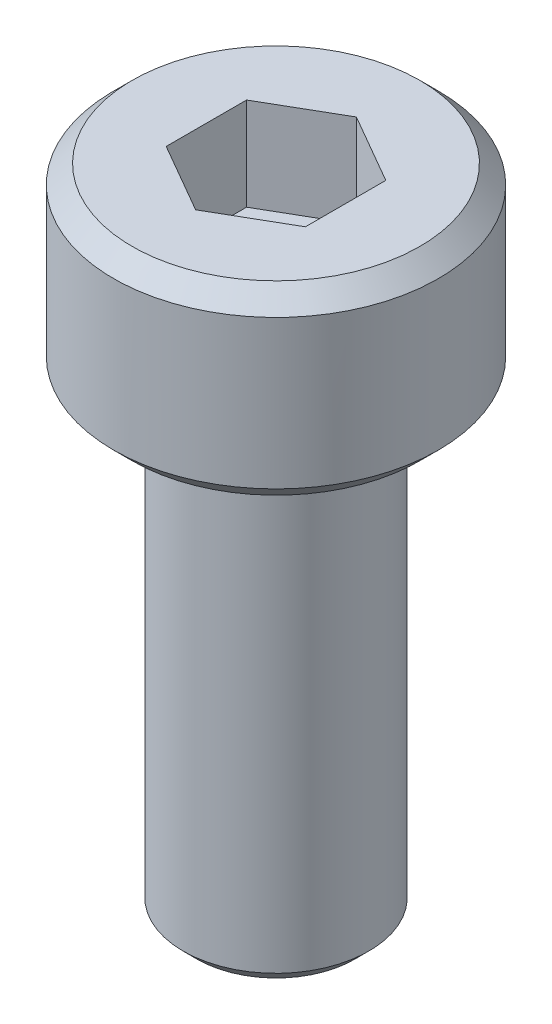
ISO-10303-21;
HEADER;
FILE_DESCRIPTION(('STEP AP214'),'2;1');
FILE_NAME('part.step','',(''),(''),'','','');
FILE_SCHEMA(('AUTOMOTIVE_DESIGN { 1 0 10303 214 1 1 1 1 }'));
ENDSEC;
DATA;
#1=APPLICATION_CONTEXT('core data for automotive mechanical design processes');
#2=APPLICATION_PROTOCOL_DEFINITION('international standard','automotive_design',2000,#1);
#3=PRODUCT_CONTEXT('',#1,'mechanical');
#4=PRODUCT('Part','Part','',(#3));
#5=PRODUCT_RELATED_PRODUCT_CATEGORY('part','',(#4));
#6=PRODUCT_DEFINITION_FORMATION('','',#4);
#7=PRODUCT_DEFINITION_CONTEXT('part definition',#1,'design');
#8=PRODUCT_DEFINITION('design','',#6,#7);
#9=PRODUCT_DEFINITION_SHAPE('','',#8);
#10=(LENGTH_UNIT() NAMED_UNIT(*) SI_UNIT(.MILLI.,.METRE.));
#11=(NAMED_UNIT(*) PLANE_ANGLE_UNIT() SI_UNIT($,.RADIAN.));
#12=(NAMED_UNIT(*) SI_UNIT($,.STERADIAN.) SOLID_ANGLE_UNIT());
#13=UNCERTAINTY_MEASURE_WITH_UNIT(LENGTH_MEASURE(1.E-05),#10,'distance_accuracy_value','');
#14=(GEOMETRIC_REPRESENTATION_CONTEXT(3) GLOBAL_UNCERTAINTY_ASSIGNED_CONTEXT((#13)) GLOBAL_UNIT_ASSIGNED_CONTEXT((#10,
#11,#12)) REPRESENTATION_CONTEXT('',''));
#15=CARTESIAN_POINT('',(0.,0.,0.));
#16=DIRECTION('',(0.,0.,1.));
#17=DIRECTION('',(1.,0.,0.));
#18=AXIS2_PLACEMENT_3D('',#15,#16,#17);
#19=CARTESIAN_POINT('',(0.,2.,-1.73205080756888));
#20=DIRECTION('',(-0.500000000000001,0.,-0.866025403784438));
#21=DIRECTION('',(-0.866025403784438,0.,0.500000000000001));
#22=AXIS2_PLACEMENT_3D('',#19,#20,#21);
#23=PLANE('',#22);
#24=DIRECTION('',(0.,1.,0.));
#25=VECTOR('',#24,1.);
#26=CARTESIAN_POINT('',(-1.5,2.,-0.866025403784438));
#27=LINE('',#26,#25);
#28=CARTESIAN_POINT('',(-1.5,4.,-0.866025403784437));
#29=VERTEX_POINT('',#28);
#30=CARTESIAN_POINT('',(-1.5,2.,-0.866025403784437));
#31=VERTEX_POINT('',#30);
#32=EDGE_CURVE('E83',#29,#31,#27,.F.);
#33=ORIENTED_EDGE('',*,*,#32,.T.);
#34=DIRECTION('',(-0.866025403784438,0.,0.500000000000001));
#35=VECTOR('',#34,1.);
#36=CARTESIAN_POINT('',(0.,2.,-1.73205080756888));
#37=LINE('',#36,#35);
#38=CARTESIAN_POINT('',(0.,2.,-1.73205080756888));
#39=VERTEX_POINT('',#38);
#40=EDGE_CURVE('E72',#39,#31,#37,.T.);
#41=ORIENTED_EDGE('',*,*,#40,.F.);
#42=DIRECTION('',(0.,1.,0.));
#43=VECTOR('',#42,1.);
#44=CARTESIAN_POINT('',(0.,2.,-1.73205080756888));
#45=LINE('',#44,#43);
#46=CARTESIAN_POINT('',(0.,4.,-1.73205080756888));
#47=VERTEX_POINT('',#46);
#48=EDGE_CURVE('E92',#39,#47,#45,.T.);
#49=ORIENTED_EDGE('',*,*,#48,.T.);
#50=DIRECTION('',(-0.866025403784438,0.,0.500000000000001));
#51=VECTOR('',#50,1.);
#52=CARTESIAN_POINT('',(0.,4.,-1.73205080756888));
#53=LINE('',#52,#51);
#54=EDGE_CURVE('E67',#29,#47,#53,.F.);
#55=ORIENTED_EDGE('',*,*,#54,.F.);
#56=EDGE_LOOP('',(#33,#41,#49,#55));
#57=FACE_BOUND('',#56,.T.);
#58=ADVANCED_FACE('F17',(#57),#23,.F.);
#59=CARTESIAN_POINT('',(-1.5,2.,-0.866025403784438));
#60=DIRECTION('',(-1.,0.,0.));
#61=DIRECTION('',(0.,0.,1.));
#62=AXIS2_PLACEMENT_3D('',#59,#60,#61);
#63=PLANE('',#62);
#64=DIRECTION('',(0.,1.,0.));
#65=VECTOR('',#64,1.);
#66=CARTESIAN_POINT('',(-1.5,2.,0.866025403784439));
#67=LINE('',#66,#65);
#68=CARTESIAN_POINT('',(-1.5,4.,0.866025403784439));
#69=VERTEX_POINT('',#68);
#70=CARTESIAN_POINT('',(-1.5,2.,0.866025403784439));
#71=VERTEX_POINT('',#70);
#72=EDGE_CURVE('E88',#69,#71,#67,.F.);
#73=ORIENTED_EDGE('',*,*,#72,.T.);
#74=DIRECTION('',(0.,0.,1.));
#75=VECTOR('',#74,1.);
#76=CARTESIAN_POINT('',(-1.5,2.,-0.866025403784438));
#77=LINE('',#76,#75);
#78=EDGE_CURVE('E76',#31,#71,#77,.T.);
#79=ORIENTED_EDGE('',*,*,#78,.F.);
#80=ORIENTED_EDGE('',*,*,#32,.F.);
#81=DIRECTION('',(0.,0.,1.));
#82=VECTOR('',#81,1.);
#83=CARTESIAN_POINT('',(-1.5,4.,-0.866025403784438));
#84=LINE('',#83,#82);
#85=EDGE_CURVE('E90',#69,#29,#84,.F.);
#86=ORIENTED_EDGE('',*,*,#85,.F.);
#87=EDGE_LOOP('',(#73,#79,#80,#86));
#88=FACE_BOUND('',#87,.T.);
#89=ADVANCED_FACE('F86',(#88),#63,.F.);
#90=CARTESIAN_POINT('',(1.5,2.,-0.866025403784438));
#91=DIRECTION('',(0.5,0.,-0.866025403784439));
#92=DIRECTION('',(-0.866025403784439,0.,-0.5));
#93=AXIS2_PLACEMENT_3D('',#90,#91,#92);
#94=PLANE('',#93);
#95=ORIENTED_EDGE('',*,*,#48,.F.);
#96=DIRECTION('',(-0.866025403784439,0.,-0.5));
#97=VECTOR('',#96,1.);
#98=CARTESIAN_POINT('',(1.5,2.,-0.866025403784438));
#99=LINE('',#98,#97);
#100=CARTESIAN_POINT('',(1.5,2.,-0.866025403784438));
#101=VERTEX_POINT('',#100);
#102=EDGE_CURVE('E79',#101,#39,#99,.T.);
#103=ORIENTED_EDGE('',*,*,#102,.F.);
#104=DIRECTION('',(0.,1.,0.));
#105=VECTOR('',#104,1.);
#106=CARTESIAN_POINT('',(1.5,2.,-0.866025403784438));
#107=LINE('',#106,#105);
#108=CARTESIAN_POINT('',(1.5,4.,-0.866025403784438));
#109=VERTEX_POINT('',#108);
#110=EDGE_CURVE('E122',#101,#109,#107,.T.);
#111=ORIENTED_EDGE('',*,*,#110,.T.);
#112=DIRECTION('',(-0.866025403784439,0.,-0.5));
#113=VECTOR('',#112,1.);
#114=CARTESIAN_POINT('',(1.5,4.,-0.866025403784438));
#115=LINE('',#114,#113);
#116=EDGE_CURVE('E134',#47,#109,#115,.F.);
#117=ORIENTED_EDGE('',*,*,#116,.F.);
#118=EDGE_LOOP('',(#95,#103,#111,#117));
#119=FACE_BOUND('',#118,.T.);
#120=ADVANCED_FACE('F137',(#119),#94,.F.);
#121=CARTESIAN_POINT('',(-1.5,2.,0.866025403784439));
#122=DIRECTION('',(-0.499999999999999,0.,0.866025403784439));
#123=DIRECTION('',(0.866025403784439,0.,0.499999999999999));
#124=AXIS2_PLACEMENT_3D('',#121,#122,#123);
#125=PLANE('',#124);
#126=DIRECTION('',(0.,1.,0.));
#127=VECTOR('',#126,1.);
#128=CARTESIAN_POINT('',(0.,2.,1.73205080756888));
#129=LINE('',#128,#127);
#130=CARTESIAN_POINT('',(0.,4.,1.73205080756888));
#131=VERTEX_POINT('',#130);
#132=CARTESIAN_POINT('',(0.,2.,1.73205080756888));
#133=VERTEX_POINT('',#132);
#134=EDGE_CURVE('E119',#131,#133,#129,.F.);
#135=ORIENTED_EDGE('',*,*,#134,.T.);
#136=DIRECTION('',(0.866025403784439,0.,0.499999999999999));
#137=VECTOR('',#136,1.);
#138=CARTESIAN_POINT('',(-1.5,2.,0.866025403784439));
#139=LINE('',#138,#137);
#140=EDGE_CURVE('E128',#71,#133,#139,.T.);
#141=ORIENTED_EDGE('',*,*,#140,.F.);
#142=ORIENTED_EDGE('',*,*,#72,.F.);
#143=DIRECTION('',(0.866025403784439,0.,0.499999999999999));
#144=VECTOR('',#143,1.);
#145=CARTESIAN_POINT('',(-1.5,4.,0.866025403784439));
#146=LINE('',#145,#144);
#147=EDGE_CURVE('E130',#131,#69,#146,.F.);
#148=ORIENTED_EDGE('',*,*,#147,.F.);
#149=EDGE_LOOP('',(#135,#141,#142,#148));
#150=FACE_BOUND('',#149,.T.);
#151=ADVANCED_FACE('F144',(#150),#125,.F.);
#152=CARTESIAN_POINT('',(1.5,2.,2.59807621135331));
#153=DIRECTION('',(0.,1.,0.));
#154=DIRECTION('',(0.,0.,1.));
#155=AXIS2_PLACEMENT_3D('',#152,#153,#154);
#156=PLANE('',#155);
#157=ORIENTED_EDGE('',*,*,#40,.T.);
#158=ORIENTED_EDGE('',*,*,#78,.T.);
#159=ORIENTED_EDGE('',*,*,#140,.T.);
#160=DIRECTION('',(0.866025403784438,0.,-0.5));
#161=VECTOR('',#160,1.);
#162=CARTESIAN_POINT('',(0.,2.,1.73205080756888));
#163=LINE('',#162,#161);
#164=CARTESIAN_POINT('',(1.5,2.,0.866025403784438));
#165=VERTEX_POINT('',#164);
#166=EDGE_CURVE('E117',#133,#165,#163,.T.);
#167=ORIENTED_EDGE('',*,*,#166,.T.);
#168=DIRECTION('',(0.,0.,-1.));
#169=VECTOR('',#168,1.);
#170=CARTESIAN_POINT('',(1.5,2.,0.866025403784438));
#171=LINE('',#170,#169);
#172=EDGE_CURVE('E125',#165,#101,#171,.T.);
#173=ORIENTED_EDGE('',*,*,#172,.T.);
#174=ORIENTED_EDGE('',*,*,#102,.T.);
#175=EDGE_LOOP('',(#157,#158,#159,#167,#173,#174));
#176=FACE_BOUND('',#175,.T.);
#177=ADVANCED_FACE('F73',(#176),#156,.T.);
#178=CARTESIAN_POINT('',(1.5,2.,0.866025403784438));
#179=DIRECTION('',(1.,0.,0.));
#180=DIRECTION('',(0.,0.,-1.));
#181=AXIS2_PLACEMENT_3D('',#178,#179,#180);
#182=PLANE('',#181);
#183=ORIENTED_EDGE('',*,*,#110,.F.);
#184=ORIENTED_EDGE('',*,*,#172,.F.);
#185=DIRECTION('',(0.,1.,0.));
#186=VECTOR('',#185,1.);
#187=CARTESIAN_POINT('',(1.5,2.,0.866025403784437));
#188=LINE('',#187,#186);
#189=CARTESIAN_POINT('',(1.5,4.,0.866025403784438));
#190=VERTEX_POINT('',#189);
#191=EDGE_CURVE('E115',#165,#190,#188,.T.);
#192=ORIENTED_EDGE('',*,*,#191,.T.);
#193=DIRECTION('',(0.,0.,-1.));
#194=VECTOR('',#193,1.);
#195=CARTESIAN_POINT('',(1.5,4.,0.866025403784438));
#196=LINE('',#195,#194);
#197=EDGE_CURVE('E35',#109,#190,#196,.F.);
#198=ORIENTED_EDGE('',*,*,#197,.F.);
#199=EDGE_LOOP('',(#183,#184,#192,#198));
#200=FACE_BOUND('',#199,.T.);
#201=ADVANCED_FACE('F151',(#200),#182,.F.);
#202=CARTESIAN_POINT('',(0.,2.,1.73205080756888));
#203=DIRECTION('',(0.5,0.,0.866025403784438));
#204=DIRECTION('',(0.866025403784438,0.,-0.5));
#205=AXIS2_PLACEMENT_3D('',#202,#203,#204);
#206=PLANE('',#205);
#207=ORIENTED_EDGE('',*,*,#191,.F.);
#208=ORIENTED_EDGE('',*,*,#166,.F.);
#209=ORIENTED_EDGE('',*,*,#134,.F.);
#210=DIRECTION('',(-0.866025403784438,0.,0.5));
#211=VECTOR('',#210,1.);
#212=CARTESIAN_POINT('',(1.5,4.,0.866025403784438));
#213=LINE('',#212,#211);
#214=EDGE_CURVE('E113',#190,#131,#213,.T.);
#215=ORIENTED_EDGE('',*,*,#214,.F.);
#216=EDGE_LOOP('',(#207,#208,#209,#215));
#217=FACE_BOUND('',#216,.T.);
#218=ADVANCED_FACE('F149',(#217),#206,.F.);
#219=CARTESIAN_POINT('',(0.,4.,0.));
#220=DIRECTION('',(0.,1.,0.));
#221=DIRECTION('',(0.,0.,1.));
#222=AXIS2_PLACEMENT_3D('',#219,#220,#221);
#223=PLANE('',#222);
#224=ORIENTED_EDGE('',*,*,#197,.T.);
#225=ORIENTED_EDGE('',*,*,#214,.T.);
#226=ORIENTED_EDGE('',*,*,#147,.T.);
#227=ORIENTED_EDGE('',*,*,#85,.T.);
#228=ORIENTED_EDGE('',*,*,#54,.T.);
#229=ORIENTED_EDGE('',*,*,#116,.T.);
#230=EDGE_LOOP('',(#224,#225,#226,#227,#228,#229));
#231=FACE_BOUND('',#230,.T.);
#232=CARTESIAN_POINT('',(0.,4.0000000000191,0.));
#233=DIRECTION('',(0.,-1.,0.));
#234=DIRECTION('',(0.,0.,-1.));
#235=AXIS2_PLACEMENT_3D('',#232,#233,#234);
#236=CIRCLE('',#235,3.10000000001764);
#237=CARTESIAN_POINT('',(0.,4.0000000000191,-3.10000000001764));
#238=VERTEX_POINT('',#237);
#239=EDGE_CURVE('E20',#238,#238,#236,.T.);
#240=ORIENTED_EDGE('',*,*,#239,.F.);
#241=EDGE_LOOP('',(#240));
#242=FACE_BOUND('',#241,.T.);
#243=ADVANCED_FACE('F139',(#231,#242),#223,.T.);
#244=CARTESIAN_POINT('',(0.,3.60000000000582,0.));
#245=DIRECTION('',(0.,-1.,0.));
#246=DIRECTION('',(0.,0.,-1.));
#247=AXIS2_PLACEMENT_3D('',#244,#245,#246);
#248=CONICAL_SURFACE('',#247,3.50000000003092,0.785398163397448);
#249=ORIENTED_EDGE('',*,*,#239,.T.);
#250=EDGE_LOOP('',(#249));
#251=FACE_BOUND('',#250,.T.);
#252=CARTESIAN_POINT('',(0.,3.6,0.));
#253=DIRECTION('',(0.,-1.,0.));
#254=DIRECTION('',(0.,0.,-1.));
#255=AXIS2_PLACEMENT_3D('',#252,#253,#254);
#256=CIRCLE('',#255,3.5);
#257=CARTESIAN_POINT('',(0.,3.6,-3.5));
#258=VERTEX_POINT('',#257);
#259=EDGE_CURVE('E105',#258,#258,#256,.T.);
#260=ORIENTED_EDGE('',*,*,#259,.F.);
#261=EDGE_LOOP('',(#260));
#262=FACE_BOUND('',#261,.T.);
#263=ADVANCED_FACE('F188',(#251,#262),#248,.T.);
#264=CARTESIAN_POINT('',(0.,4.,0.));
#265=DIRECTION('',(0.,-1.,0.));
#266=DIRECTION('',(0.,0.,-1.));
#267=AXIS2_PLACEMENT_3D('',#264,#265,#266);
#268=CYLINDRICAL_SURFACE('',#267,3.5);
#269=ORIENTED_EDGE('',*,*,#259,.T.);
#270=EDGE_LOOP('',(#269));
#271=FACE_BOUND('',#270,.T.);
#272=CARTESIAN_POINT('',(0.,0.400000000013279,0.));
#273=DIRECTION('',(0.,1.,0.));
#274=DIRECTION('',(0.,0.,1.));
#275=AXIS2_PLACEMENT_3D('',#272,#273,#274);
#276=CIRCLE('',#275,3.50000000003092);
#277=CARTESIAN_POINT('',(0.,0.400000000013279,3.50000000003092));
#278=VERTEX_POINT('',#277);
#279=EDGE_CURVE('E101',#278,#278,#276,.F.);
#280=ORIENTED_EDGE('',*,*,#279,.F.);
#281=EDGE_LOOP('',(#280));
#282=FACE_BOUND('',#281,.T.);
#283=ADVANCED_FACE('F184',(#271,#282),#268,.T.);
#284=CARTESIAN_POINT('',(0.,-10.,0.));
#285=DIRECTION('',(0.,1.,0.));
#286=DIRECTION('',(0.,0.,1.));
#287=AXIS2_PLACEMENT_3D('',#284,#285,#286);
#288=PLANE('',#287);
#289=CARTESIAN_POINT('',(0.,-9.99999999999091,0.));
#290=DIRECTION('',(0.,1.,0.));
#291=DIRECTION('',(0.,0.,1.));
#292=AXIS2_PLACEMENT_3D('',#289,#290,#291);
#293=CIRCLE('',#292,1.70000000008486);
#294=CARTESIAN_POINT('',(0.,-9.99999999999091,1.70000000008486));
#295=VERTEX_POINT('',#294);
#296=EDGE_CURVE('E99',#295,#295,#293,.T.);
#297=ORIENTED_EDGE('',*,*,#296,.F.);
#298=EDGE_LOOP('',(#297));
#299=FACE_BOUND('',#298,.T.);
#300=ADVANCED_FACE('F180',(#299),#288,.F.);
#301=CARTESIAN_POINT('',(0.,0.399999999956435,0.));
#302=DIRECTION('',(0.,1.,0.));
#303=DIRECTION('',(0.,0.,1.));
#304=AXIS2_PLACEMENT_3D('',#301,#302,#303);
#305=CONICAL_SURFACE('',#304,3.49999999991724,0.785398163326394);
#306=CARTESIAN_POINT('',(0.,5.6843418860808E-11,0.));
#307=DIRECTION('',(0.,1.,0.));
#308=DIRECTION('',(0.,0.,1.));
#309=AXIS2_PLACEMENT_3D('',#306,#307,#308);
#310=CIRCLE('',#309,3.10000000007449);
#311=CARTESIAN_POINT('',(0.,5.6843418860808E-11,3.10000000007449));
#312=VERTEX_POINT('',#311);
#313=EDGE_CURVE('E97',#312,#312,#310,.T.);
#314=ORIENTED_EDGE('',*,*,#313,.T.);
#315=EDGE_LOOP('',(#314));
#316=FACE_BOUND('',#315,.T.);
#317=ORIENTED_EDGE('',*,*,#279,.T.);
#318=EDGE_LOOP('',(#317));
#319=FACE_BOUND('',#318,.T.);
#320=ADVANCED_FACE('F176',(#316,#319),#305,.T.);
#321=CARTESIAN_POINT('',(0.,-9.70000000012305,0.));
#322=DIRECTION('',(0.,1.,0.));
#323=DIRECTION('',(0.,0.,1.));
#324=AXIS2_PLACEMENT_3D('',#321,#322,#323);
#325=CONICAL_SURFACE('',#324,1.99999999995271,0.785398163397448);
#326=CARTESIAN_POINT('',(0.,-9.7,0.));
#327=DIRECTION('',(0.,1.,0.));
#328=DIRECTION('',(0.,0.,1.));
#329=AXIS2_PLACEMENT_3D('',#326,#327,#328);
#330=CIRCLE('',#329,2.);
#331=CARTESIAN_POINT('',(0.,-9.7,2.));
#332=VERTEX_POINT('',#331);
#333=EDGE_CURVE('E26',#332,#332,#330,.T.);
#334=ORIENTED_EDGE('',*,*,#333,.F.);
#335=EDGE_LOOP('',(#334));
#336=FACE_BOUND('',#335,.T.);
#337=ORIENTED_EDGE('',*,*,#296,.T.);
#338=EDGE_LOOP('',(#337));
#339=FACE_BOUND('',#338,.T.);
#340=ADVANCED_FACE('F169',(#336,#339),#325,.T.);
#341=CARTESIAN_POINT('',(0.,0.,0.));
#342=DIRECTION('',(0.,1.,0.));
#343=DIRECTION('',(0.,0.,1.));
#344=AXIS2_PLACEMENT_3D('',#341,#342,#343);
#345=PLANE('',#344);
#346=CARTESIAN_POINT('',(0.,0.,0.));
#347=DIRECTION('',(0.,1.,0.));
#348=DIRECTION('',(0.,0.,1.));
#349=AXIS2_PLACEMENT_3D('',#346,#347,#348);
#350=CIRCLE('',#349,2.);
#351=CARTESIAN_POINT('',(0.,0.,2.));
#352=VERTEX_POINT('',#351);
#353=EDGE_CURVE('E11',#352,#352,#350,.F.);
#354=ORIENTED_EDGE('',*,*,#353,.F.);
#355=EDGE_LOOP('',(#354));
#356=FACE_BOUND('',#355,.T.);
#357=ORIENTED_EDGE('',*,*,#313,.F.);
#358=EDGE_LOOP('',(#357));
#359=FACE_BOUND('',#358,.T.);
#360=ADVANCED_FACE('F163',(#356,#359),#345,.F.);
#361=CARTESIAN_POINT('',(0.,-10.,0.));
#362=DIRECTION('',(0.,1.,0.));
#363=DIRECTION('',(0.,0.,1.));
#364=AXIS2_PLACEMENT_3D('',#361,#362,#363);
#365=CYLINDRICAL_SURFACE('',#364,2.);
#366=ORIENTED_EDGE('',*,*,#353,.T.);
#367=EDGE_LOOP('',(#366));
#368=FACE_BOUND('',#367,.T.);
#369=ORIENTED_EDGE('',*,*,#333,.T.);
#370=EDGE_LOOP('',(#369));
#371=FACE_BOUND('',#370,.T.);
#372=ADVANCED_FACE('F161',(#368,#371),#365,.T.);
#373=CLOSED_SHELL('',(#58,#89,#120,#151,#177,#201,#218,#243,#263,#283,#300,#320,#340,#360,#372));
#374=MANIFOLD_SOLID_BREP('B1',#373);
#375=ADVANCED_BREP_SHAPE_REPRESENTATION('',(#18,#374),#14);
#376=SHAPE_DEFINITION_REPRESENTATION(#9,#375);
ENDSEC;
END-ISO-10303-21;
